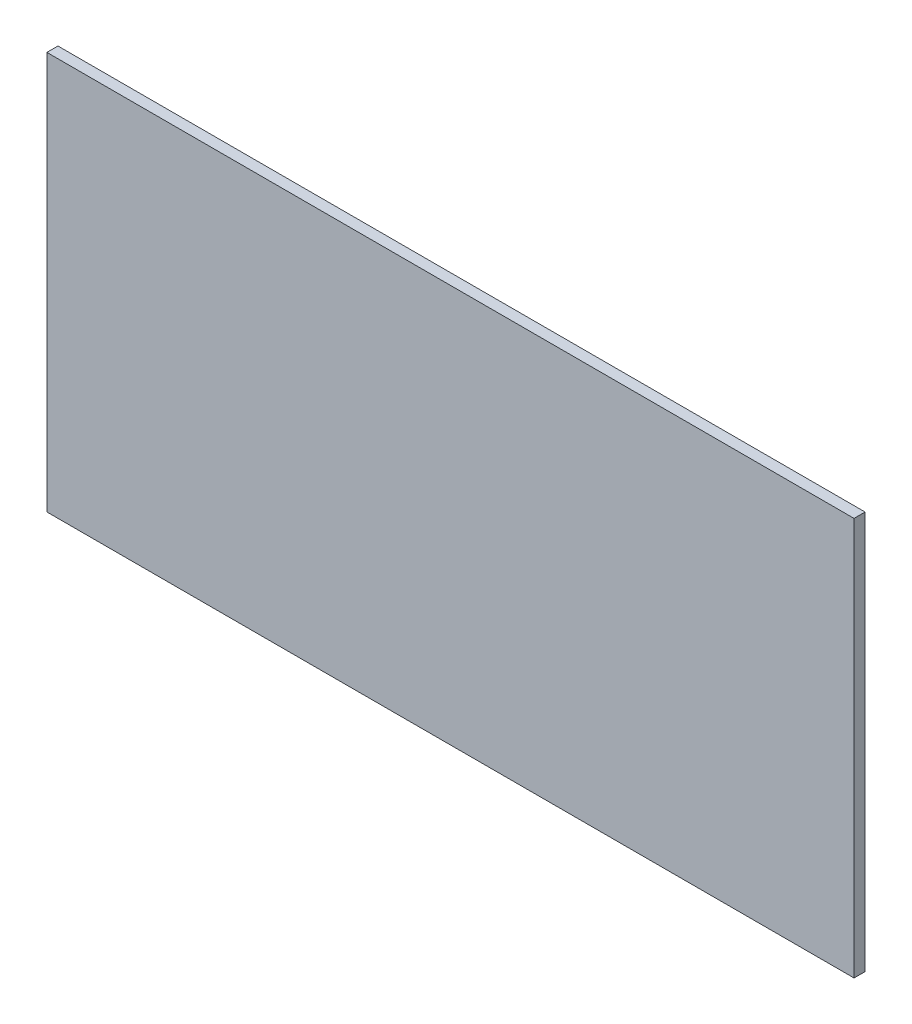
ISO-10303-21;
HEADER;
FILE_DESCRIPTION(('STEP AP214'),'2;1');
FILE_NAME('part.step','',(''),(''),'','','');
FILE_SCHEMA(('AUTOMOTIVE_DESIGN { 1 0 10303 214 1 1 1 1 }'));
ENDSEC;
DATA;
#1=APPLICATION_CONTEXT('core data for automotive mechanical design processes');
#2=APPLICATION_PROTOCOL_DEFINITION('international standard','automotive_design',2000,#1);
#3=PRODUCT_CONTEXT('',#1,'mechanical');
#4=PRODUCT('Part','Part','',(#3));
#5=PRODUCT_RELATED_PRODUCT_CATEGORY('part','',(#4));
#6=PRODUCT_DEFINITION_FORMATION('','',#4);
#7=PRODUCT_DEFINITION_CONTEXT('part definition',#1,'design');
#8=PRODUCT_DEFINITION('design','',#6,#7);
#9=PRODUCT_DEFINITION_SHAPE('','',#8);
#10=(LENGTH_UNIT() NAMED_UNIT(*) SI_UNIT(.MILLI.,.METRE.));
#11=(NAMED_UNIT(*) PLANE_ANGLE_UNIT() SI_UNIT($,.RADIAN.));
#12=(NAMED_UNIT(*) SI_UNIT($,.STERADIAN.) SOLID_ANGLE_UNIT());
#13=UNCERTAINTY_MEASURE_WITH_UNIT(LENGTH_MEASURE(1.E-05),#10,'distance_accuracy_value','');
#14=(GEOMETRIC_REPRESENTATION_CONTEXT(3) GLOBAL_UNCERTAINTY_ASSIGNED_CONTEXT((#13)) GLOBAL_UNIT_ASSIGNED_CONTEXT((#10,
#11,#12)) REPRESENTATION_CONTEXT('',''));
#15=CARTESIAN_POINT('',(0.,0.,0.));
#16=DIRECTION('',(0.,0.,1.));
#17=DIRECTION('',(1.,0.,0.));
#18=AXIS2_PLACEMENT_3D('',#15,#16,#17);
#19=CARTESIAN_POINT('',(69.35,1.8,1.));
#20=DIRECTION('',(-1.,0.,0.));
#21=DIRECTION('',(0.,0.,1.));
#22=AXIS2_PLACEMENT_3D('',#19,#20,#21);
#23=PLANE('',#22);
#24=DIRECTION('',(0.,1.,0.));
#25=VECTOR('',#24,1.);
#26=CARTESIAN_POINT('',(69.35,1.8,0.));
#27=LINE('',#26,#25);
#28=CARTESIAN_POINT('',(69.35,-34.2,0.));
#29=VERTEX_POINT('',#28);
#30=CARTESIAN_POINT('',(69.35,1.8,0.));
#31=VERTEX_POINT('',#30);
#32=EDGE_CURVE('E106',#29,#31,#27,.T.);
#33=ORIENTED_EDGE('',*,*,#32,.T.);
#34=DIRECTION('',(0.,0.,-1.));
#35=VECTOR('',#34,1.);
#36=CARTESIAN_POINT('',(69.35,1.8,1.));
#37=LINE('',#36,#35);
#38=CARTESIAN_POINT('',(69.35,1.8,1.));
#39=VERTEX_POINT('',#38);
#40=EDGE_CURVE('E11',#39,#31,#37,.T.);
#41=ORIENTED_EDGE('',*,*,#40,.F.);
#42=DIRECTION('',(0.,1.,0.));
#43=VECTOR('',#42,1.);
#44=CARTESIAN_POINT('',(69.35,1.8,1.));
#45=LINE('',#44,#43);
#46=CARTESIAN_POINT('',(69.35,-34.2,1.));
#47=VERTEX_POINT('',#46);
#48=EDGE_CURVE('E94',#47,#39,#45,.T.);
#49=ORIENTED_EDGE('',*,*,#48,.F.);
#50=DIRECTION('',(0.,0.,-1.));
#51=VECTOR('',#50,1.);
#52=CARTESIAN_POINT('',(69.35,-34.2,1.));
#53=LINE('',#52,#51);
#54=EDGE_CURVE('E102',#47,#29,#53,.T.);
#55=ORIENTED_EDGE('',*,*,#54,.T.);
#56=EDGE_LOOP('',(#33,#41,#49,#55));
#57=FACE_BOUND('',#56,.T.);
#58=ADVANCED_FACE('F43',(#57),#23,.F.);
#59=CARTESIAN_POINT('',(-3.65,1.8,1.));
#60=DIRECTION('',(0.,-1.,0.));
#61=DIRECTION('',(0.,0.,-1.));
#62=AXIS2_PLACEMENT_3D('',#59,#60,#61);
#63=PLANE('',#62);
#64=DIRECTION('',(-1.,0.,0.));
#65=VECTOR('',#64,1.);
#66=CARTESIAN_POINT('',(-3.65,1.8,0.));
#67=LINE('',#66,#65);
#68=CARTESIAN_POINT('',(-3.65,1.8,0.));
#69=VERTEX_POINT('',#68);
#70=EDGE_CURVE('E98',#31,#69,#67,.T.);
#71=ORIENTED_EDGE('',*,*,#70,.T.);
#72=DIRECTION('',(0.,0.,-1.));
#73=VECTOR('',#72,1.);
#74=CARTESIAN_POINT('',(-3.65,1.8,1.));
#75=LINE('',#74,#73);
#76=CARTESIAN_POINT('',(-3.65,1.8,1.));
#77=VERTEX_POINT('',#76);
#78=EDGE_CURVE('E51',#77,#69,#75,.T.);
#79=ORIENTED_EDGE('',*,*,#78,.F.);
#80=DIRECTION('',(-1.,0.,0.));
#81=VECTOR('',#80,1.);
#82=CARTESIAN_POINT('',(-3.65,1.8,1.));
#83=LINE('',#82,#81);
#84=EDGE_CURVE('E89',#39,#77,#83,.T.);
#85=ORIENTED_EDGE('',*,*,#84,.F.);
#86=ORIENTED_EDGE('',*,*,#40,.T.);
#87=EDGE_LOOP('',(#71,#79,#85,#86));
#88=FACE_BOUND('',#87,.T.);
#89=ADVANCED_FACE('F97',(#88),#63,.F.);
#90=CARTESIAN_POINT('',(-3.65,1.8,1.));
#91=DIRECTION('',(1.,0.,0.));
#92=DIRECTION('',(0.,1.,0.));
#93=AXIS2_PLACEMENT_3D('',#90,#91,#92);
#94=PLANE('',#93);
#95=DIRECTION('',(0.,-1.,0.));
#96=VECTOR('',#95,1.);
#97=CARTESIAN_POINT('',(-3.65,1.8,0.));
#98=LINE('',#97,#96);
#99=CARTESIAN_POINT('',(-3.65,-34.2,0.));
#100=VERTEX_POINT('',#99);
#101=EDGE_CURVE('E76',#69,#100,#98,.T.);
#102=ORIENTED_EDGE('',*,*,#101,.T.);
#103=DIRECTION('',(0.,0.,-1.));
#104=VECTOR('',#103,1.);
#105=CARTESIAN_POINT('',(-3.65,-34.2,1.));
#106=LINE('',#105,#104);
#107=CARTESIAN_POINT('',(-3.65,-34.2,1.));
#108=VERTEX_POINT('',#107);
#109=EDGE_CURVE('E99',#108,#100,#106,.T.);
#110=ORIENTED_EDGE('',*,*,#109,.F.);
#111=DIRECTION('',(0.,-1.,0.));
#112=VECTOR('',#111,1.);
#113=CARTESIAN_POINT('',(-3.65,1.8,1.));
#114=LINE('',#113,#112);
#115=EDGE_CURVE('E92',#77,#108,#114,.T.);
#116=ORIENTED_EDGE('',*,*,#115,.F.);
#117=ORIENTED_EDGE('',*,*,#78,.T.);
#118=EDGE_LOOP('',(#102,#110,#116,#117));
#119=FACE_BOUND('',#118,.T.);
#120=ADVANCED_FACE('F100',(#119),#94,.F.);
#121=CARTESIAN_POINT('',(-3.65,-34.2,1.));
#122=DIRECTION('',(0.,1.,0.));
#123=DIRECTION('',(0.,0.,1.));
#124=AXIS2_PLACEMENT_3D('',#121,#122,#123);
#125=PLANE('',#124);
#126=DIRECTION('',(1.,0.,0.));
#127=VECTOR('',#126,1.);
#128=CARTESIAN_POINT('',(-3.65,-34.2,0.));
#129=LINE('',#128,#127);
#130=EDGE_CURVE('E82',#100,#29,#129,.T.);
#131=ORIENTED_EDGE('',*,*,#130,.T.);
#132=ORIENTED_EDGE('',*,*,#54,.F.);
#133=DIRECTION('',(1.,0.,0.));
#134=VECTOR('',#133,1.);
#135=CARTESIAN_POINT('',(-3.65,-34.2,1.));
#136=LINE('',#135,#134);
#137=EDGE_CURVE('E59',#108,#47,#136,.T.);
#138=ORIENTED_EDGE('',*,*,#137,.F.);
#139=ORIENTED_EDGE('',*,*,#109,.T.);
#140=EDGE_LOOP('',(#131,#132,#138,#139));
#141=FACE_BOUND('',#140,.T.);
#142=ADVANCED_FACE('F113',(#141),#125,.F.);
#143=CARTESIAN_POINT('',(0.,0.,1.));
#144=DIRECTION('',(0.,0.,1.));
#145=DIRECTION('',(1.,0.,0.));
#146=AXIS2_PLACEMENT_3D('',#143,#144,#145);
#147=PLANE('',#146);
#148=ORIENTED_EDGE('',*,*,#48,.T.);
#149=ORIENTED_EDGE('',*,*,#84,.T.);
#150=ORIENTED_EDGE('',*,*,#115,.T.);
#151=ORIENTED_EDGE('',*,*,#137,.T.);
#152=EDGE_LOOP('',(#148,#149,#150,#151));
#153=FACE_BOUND('',#152,.T.);
#154=ADVANCED_FACE('F90',(#153),#147,.T.);
#155=CARTESIAN_POINT('',(0.,0.,0.));
#156=DIRECTION('',(0.,0.,1.));
#157=DIRECTION('',(1.,0.,0.));
#158=AXIS2_PLACEMENT_3D('',#155,#156,#157);
#159=PLANE('',#158);
#160=ORIENTED_EDGE('',*,*,#32,.F.);
#161=ORIENTED_EDGE('',*,*,#130,.F.);
#162=ORIENTED_EDGE('',*,*,#101,.F.);
#163=ORIENTED_EDGE('',*,*,#70,.F.);
#164=EDGE_LOOP('',(#160,#161,#162,#163));
#165=FACE_BOUND('',#164,.T.);
#166=ADVANCED_FACE('F116',(#165),#159,.F.);
#167=CLOSED_SHELL('',(#58,#89,#120,#142,#154,#166));
#168=MANIFOLD_SOLID_BREP('B2',#167);
#169=ADVANCED_BREP_SHAPE_REPRESENTATION('',(#18,#168),#14);
#170=SHAPE_DEFINITION_REPRESENTATION(#9,#169);
ENDSEC;
END-ISO-10303-21;
